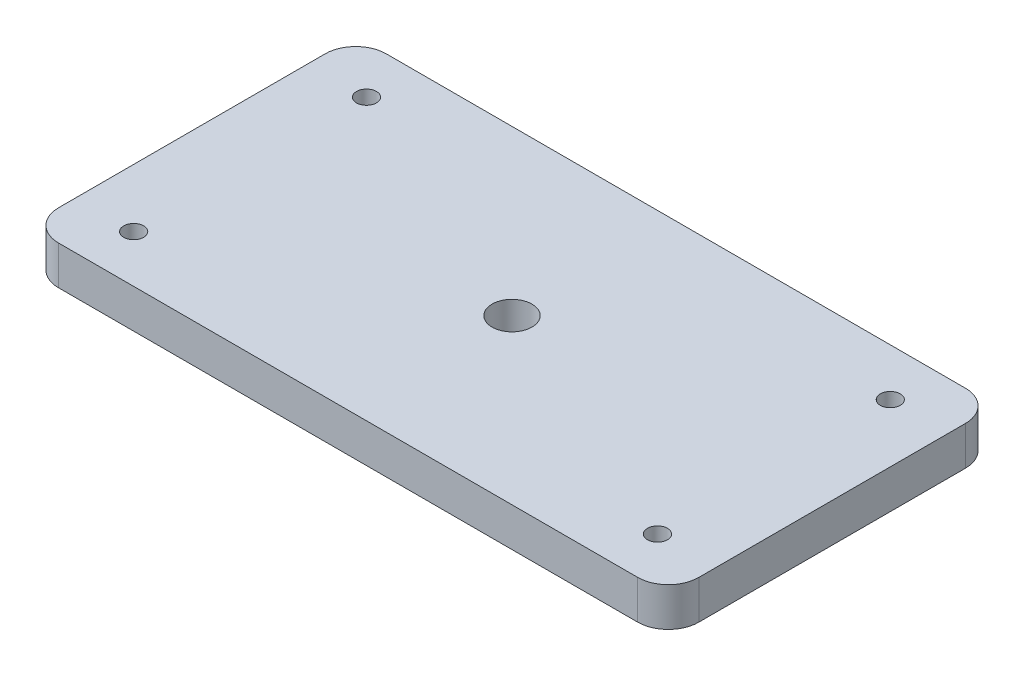
ISO-10303-21;
HEADER;
FILE_DESCRIPTION(('STEP AP214'),'2;1');
FILE_NAME('part.step','',(''),(''),'','','');
FILE_SCHEMA(('AUTOMOTIVE_DESIGN { 1 0 10303 214 1 1 1 1 }'));
ENDSEC;
DATA;
#1=APPLICATION_CONTEXT('core data for automotive mechanical design processes');
#2=APPLICATION_PROTOCOL_DEFINITION('international standard','automotive_design',2000,#1);
#3=PRODUCT_CONTEXT('',#1,'mechanical');
#4=PRODUCT('Part','Part','',(#3));
#5=PRODUCT_RELATED_PRODUCT_CATEGORY('part','',(#4));
#6=PRODUCT_DEFINITION_FORMATION('','',#4);
#7=PRODUCT_DEFINITION_CONTEXT('part definition',#1,'design');
#8=PRODUCT_DEFINITION('design','',#6,#7);
#9=PRODUCT_DEFINITION_SHAPE('','',#8);
#10=(LENGTH_UNIT() NAMED_UNIT(*) SI_UNIT(.MILLI.,.METRE.));
#11=(NAMED_UNIT(*) PLANE_ANGLE_UNIT() SI_UNIT($,.RADIAN.));
#12=(NAMED_UNIT(*) SI_UNIT($,.STERADIAN.) SOLID_ANGLE_UNIT());
#13=UNCERTAINTY_MEASURE_WITH_UNIT(LENGTH_MEASURE(1.E-05),#10,'distance_accuracy_value','');
#14=(GEOMETRIC_REPRESENTATION_CONTEXT(3) GLOBAL_UNCERTAINTY_ASSIGNED_CONTEXT((#13)) GLOBAL_UNIT_ASSIGNED_CONTEXT((#10,
#11,#12)) REPRESENTATION_CONTEXT('',''));
#15=CARTESIAN_POINT('',(0.,0.,0.));
#16=DIRECTION('',(0.,0.,1.));
#17=DIRECTION('',(1.,0.,0.));
#18=AXIS2_PLACEMENT_3D('',#15,#16,#17);
#19=CARTESIAN_POINT('',(0.,6.35,-53.63));
#20=DIRECTION('',(1.,0.,0.));
#21=DIRECTION('',(0.,0.,-1.));
#22=AXIS2_PLACEMENT_3D('',#19,#20,#21);
#23=PLANE('',#22);
#24=DIRECTION('',(0.,0.,1.));
#25=VECTOR('',#24,1.);
#26=CARTESIAN_POINT('',(0.,6.35,-53.63));
#27=LINE('',#26,#25);
#28=CARTESIAN_POINT('',(0.,6.35,-48.63));
#29=VERTEX_POINT('',#28);
#30=CARTESIAN_POINT('',(0.,6.35,-5.));
#31=VERTEX_POINT('',#30);
#32=EDGE_CURVE('E126',#29,#31,#27,.T.);
#33=ORIENTED_EDGE('',*,*,#32,.F.);
#34=DIRECTION('',(0.,-1.,0.));
#35=VECTOR('',#34,1.);
#36=CARTESIAN_POINT('',(0.,6.35,-48.63));
#37=LINE('',#36,#35);
#38=CARTESIAN_POINT('',(0.,0.,-48.63));
#39=VERTEX_POINT('',#38);
#40=EDGE_CURVE('E110',#29,#39,#37,.T.);
#41=ORIENTED_EDGE('',*,*,#40,.T.);
#42=DIRECTION('',(0.,0.,1.));
#43=VECTOR('',#42,1.);
#44=CARTESIAN_POINT('',(0.,0.,-53.63));
#45=LINE('',#44,#43);
#46=CARTESIAN_POINT('',(0.,0.,-5.));
#47=VERTEX_POINT('',#46);
#48=EDGE_CURVE('E123',#39,#47,#45,.T.);
#49=ORIENTED_EDGE('',*,*,#48,.T.);
#50=DIRECTION('',(0.,-1.,0.));
#51=VECTOR('',#50,1.);
#52=CARTESIAN_POINT('',(0.,6.35,-5.));
#53=LINE('',#52,#51);
#54=EDGE_CURVE('E129',#47,#31,#53,.F.);
#55=ORIENTED_EDGE('',*,*,#54,.T.);
#56=EDGE_LOOP('',(#33,#41,#49,#55));
#57=FACE_BOUND('',#56,.T.);
#58=ADVANCED_FACE('F39',(#57),#23,.F.);
#59=CARTESIAN_POINT('',(0.,6.35,0.));
#60=DIRECTION('',(0.,0.,-1.));
#61=DIRECTION('',(-1.,0.,0.));
#62=AXIS2_PLACEMENT_3D('',#59,#60,#61);
#63=PLANE('',#62);
#64=DIRECTION('',(1.,0.,0.));
#65=VECTOR('',#64,1.);
#66=CARTESIAN_POINT('',(0.,0.,0.));
#67=LINE('',#66,#65);
#68=CARTESIAN_POINT('',(5.,0.,0.));
#69=VERTEX_POINT('',#68);
#70=CARTESIAN_POINT('',(99.78,0.,0.));
#71=VERTEX_POINT('',#70);
#72=EDGE_CURVE('E134',#69,#71,#67,.T.);
#73=ORIENTED_EDGE('',*,*,#72,.T.);
#74=DIRECTION('',(0.,-1.,0.));
#75=VECTOR('',#74,1.);
#76=CARTESIAN_POINT('',(99.78,6.35,0.));
#77=LINE('',#76,#75);
#78=CARTESIAN_POINT('',(99.78,6.35,0.));
#79=VERTEX_POINT('',#78);
#80=EDGE_CURVE('E11',#71,#79,#77,.F.);
#81=ORIENTED_EDGE('',*,*,#80,.T.);
#82=DIRECTION('',(1.,0.,0.));
#83=VECTOR('',#82,1.);
#84=CARTESIAN_POINT('',(0.,6.35,0.));
#85=LINE('',#84,#83);
#86=CARTESIAN_POINT('',(5.,6.35,0.));
#87=VERTEX_POINT('',#86);
#88=EDGE_CURVE('E191',#87,#79,#85,.T.);
#89=ORIENTED_EDGE('',*,*,#88,.F.);
#90=DIRECTION('',(0.,-1.,0.));
#91=VECTOR('',#90,1.);
#92=CARTESIAN_POINT('',(5.,6.35,0.));
#93=LINE('',#92,#91);
#94=EDGE_CURVE('E48',#87,#69,#93,.T.);
#95=ORIENTED_EDGE('',*,*,#94,.T.);
#96=EDGE_LOOP('',(#73,#81,#89,#95));
#97=FACE_BOUND('',#96,.T.);
#98=ADVANCED_FACE('F189',(#97),#63,.F.);
#99=CARTESIAN_POINT('',(104.78,6.35,-53.63));
#100=DIRECTION('',(-1.,0.,0.));
#101=DIRECTION('',(0.,0.,1.));
#102=AXIS2_PLACEMENT_3D('',#99,#100,#101);
#103=PLANE('',#102);
#104=DIRECTION('',(0.,0.,-1.));
#105=VECTOR('',#104,1.);
#106=CARTESIAN_POINT('',(104.78,0.,-53.63));
#107=LINE('',#106,#105);
#108=CARTESIAN_POINT('',(104.78,0.,-5.));
#109=VERTEX_POINT('',#108);
#110=CARTESIAN_POINT('',(104.78,0.,-48.63));
#111=VERTEX_POINT('',#110);
#112=EDGE_CURVE('E140',#109,#111,#107,.T.);
#113=ORIENTED_EDGE('',*,*,#112,.T.);
#114=DIRECTION('',(0.,-1.,0.));
#115=VECTOR('',#114,1.);
#116=CARTESIAN_POINT('',(104.78,6.35,-48.63));
#117=LINE('',#116,#115);
#118=CARTESIAN_POINT('',(104.78,6.35,-48.63));
#119=VERTEX_POINT('',#118);
#120=EDGE_CURVE('E55',#111,#119,#117,.F.);
#121=ORIENTED_EDGE('',*,*,#120,.T.);
#122=DIRECTION('',(0.,0.,-1.));
#123=VECTOR('',#122,1.);
#124=CARTESIAN_POINT('',(104.78,6.35,-53.63));
#125=LINE('',#124,#123);
#126=CARTESIAN_POINT('',(104.78,6.35,-5.));
#127=VERTEX_POINT('',#126);
#128=EDGE_CURVE('E199',#127,#119,#125,.T.);
#129=ORIENTED_EDGE('',*,*,#128,.F.);
#130=DIRECTION('',(0.,-1.,0.));
#131=VECTOR('',#130,1.);
#132=CARTESIAN_POINT('',(104.78,6.35,-5.));
#133=LINE('',#132,#131);
#134=EDGE_CURVE('E179',#127,#109,#133,.T.);
#135=ORIENTED_EDGE('',*,*,#134,.T.);
#136=EDGE_LOOP('',(#113,#121,#129,#135));
#137=FACE_BOUND('',#136,.T.);
#138=ADVANCED_FACE('F198',(#137),#103,.F.);
#139=CARTESIAN_POINT('',(0.,6.35,-53.63));
#140=DIRECTION('',(0.,0.,1.));
#141=DIRECTION('',(1.,0.,0.));
#142=AXIS2_PLACEMENT_3D('',#139,#140,#141);
#143=PLANE('',#142);
#144=DIRECTION('',(-1.,0.,0.));
#145=VECTOR('',#144,1.);
#146=CARTESIAN_POINT('',(0.,0.,-53.63));
#147=LINE('',#146,#145);
#148=CARTESIAN_POINT('',(99.78,0.,-53.63));
#149=VERTEX_POINT('',#148);
#150=CARTESIAN_POINT('',(5.,0.,-53.63));
#151=VERTEX_POINT('',#150);
#152=EDGE_CURVE('E151',#149,#151,#147,.T.);
#153=ORIENTED_EDGE('',*,*,#152,.T.);
#154=DIRECTION('',(0.,-1.,0.));
#155=VECTOR('',#154,1.);
#156=CARTESIAN_POINT('',(5.,6.35,-53.63));
#157=LINE('',#156,#155);
#158=CARTESIAN_POINT('',(5.,6.35,-53.63));
#159=VERTEX_POINT('',#158);
#160=EDGE_CURVE('E111',#151,#159,#157,.F.);
#161=ORIENTED_EDGE('',*,*,#160,.T.);
#162=DIRECTION('',(-1.,0.,0.));
#163=VECTOR('',#162,1.);
#164=CARTESIAN_POINT('',(0.,6.35,-53.63));
#165=LINE('',#164,#163);
#166=CARTESIAN_POINT('',(99.78,6.35,-53.63));
#167=VERTEX_POINT('',#166);
#168=EDGE_CURVE('E146',#167,#159,#165,.T.);
#169=ORIENTED_EDGE('',*,*,#168,.F.);
#170=DIRECTION('',(0.,-1.,0.));
#171=VECTOR('',#170,1.);
#172=CARTESIAN_POINT('',(99.78,6.35,-53.63));
#173=LINE('',#172,#171);
#174=EDGE_CURVE('E117',#167,#149,#173,.T.);
#175=ORIENTED_EDGE('',*,*,#174,.T.);
#176=EDGE_LOOP('',(#153,#161,#169,#175));
#177=FACE_BOUND('',#176,.T.);
#178=ADVANCED_FACE('F294',(#177),#143,.F.);
#179=CARTESIAN_POINT('',(0.,6.35,0.));
#180=DIRECTION('',(0.,1.,0.));
#181=DIRECTION('',(0.,0.,1.));
#182=AXIS2_PLACEMENT_3D('',#179,#180,#181);
#183=PLANE('',#182);
#184=CARTESIAN_POINT('',(9.52499999999998,6.35,-7.76499999999994));
#185=DIRECTION('',(0.,-1.,0.));
#186=DIRECTION('',(0.,0.,-1.));
#187=AXIS2_PLACEMENT_3D('',#184,#185,#186);
#188=CIRCLE('',#187,1.63195);
#189=CARTESIAN_POINT('',(9.52499999999998,6.35,-9.39694999999993));
#190=VERTEX_POINT('',#189);
#191=EDGE_CURVE('E236',#190,#190,#188,.T.);
#192=ORIENTED_EDGE('',*,*,#191,.T.);
#193=EDGE_LOOP('',(#192));
#194=FACE_BOUND('',#193,.T.);
#195=CARTESIAN_POINT('',(9.52499999999998,6.35,-45.865));
#196=DIRECTION('',(0.,-1.,0.));
#197=DIRECTION('',(0.,0.,-1.));
#198=AXIS2_PLACEMENT_3D('',#195,#196,#197);
#199=CIRCLE('',#198,1.63195);
#200=CARTESIAN_POINT('',(9.52499999999998,6.35,-47.49695));
#201=VERTEX_POINT('',#200);
#202=EDGE_CURVE('E228',#201,#201,#199,.T.);
#203=ORIENTED_EDGE('',*,*,#202,.T.);
#204=EDGE_LOOP('',(#203));
#205=FACE_BOUND('',#204,.T.);
#206=CARTESIAN_POINT('',(95.25,6.35,-45.8649999999999));
#207=DIRECTION('',(0.,-1.,0.));
#208=DIRECTION('',(0.,0.,-1.));
#209=AXIS2_PLACEMENT_3D('',#206,#207,#208);
#210=CIRCLE('',#209,1.63194999999999);
#211=CARTESIAN_POINT('',(95.25,6.35,-47.4969499999999));
#212=VERTEX_POINT('',#211);
#213=EDGE_CURVE('E220',#212,#212,#210,.T.);
#214=ORIENTED_EDGE('',*,*,#213,.T.);
#215=EDGE_LOOP('',(#214));
#216=FACE_BOUND('',#215,.T.);
#217=CARTESIAN_POINT('',(95.25,6.35,-7.76499999999993));
#218=DIRECTION('',(0.,-1.,0.));
#219=DIRECTION('',(0.,0.,-1.));
#220=AXIS2_PLACEMENT_3D('',#217,#218,#219);
#221=CIRCLE('',#220,1.63194999999999);
#222=CARTESIAN_POINT('',(95.25,6.35,-9.39694999999992));
#223=VERTEX_POINT('',#222);
#224=EDGE_CURVE('E212',#223,#223,#221,.T.);
#225=ORIENTED_EDGE('',*,*,#224,.T.);
#226=EDGE_LOOP('',(#225));
#227=FACE_BOUND('',#226,.T.);
#228=CARTESIAN_POINT('',(52.39,6.35,-26.815));
#229=DIRECTION('',(0.,-1.,0.));
#230=DIRECTION('',(0.,0.,-1.));
#231=AXIS2_PLACEMENT_3D('',#228,#229,#230);
#232=CIRCLE('',#231,3.2639);
#233=CARTESIAN_POINT('',(52.39,6.35,-30.0789));
#234=VERTEX_POINT('',#233);
#235=EDGE_CURVE('E135',#234,#234,#232,.T.);
#236=ORIENTED_EDGE('',*,*,#235,.T.);
#237=EDGE_LOOP('',(#236));
#238=FACE_BOUND('',#237,.T.);
#239=ORIENTED_EDGE('',*,*,#168,.T.);
#240=CARTESIAN_POINT('',(5.,6.35,-48.63));
#241=DIRECTION('',(0.,1.,0.));
#242=DIRECTION('',(0.,0.,1.));
#243=AXIS2_PLACEMENT_3D('',#240,#241,#242);
#244=CIRCLE('',#243,5.);
#245=EDGE_CURVE('E176',#159,#29,#244,.T.);
#246=ORIENTED_EDGE('',*,*,#245,.T.);
#247=ORIENTED_EDGE('',*,*,#32,.T.);
#248=CARTESIAN_POINT('',(5.,6.35,-5.));
#249=DIRECTION('',(0.,1.,0.));
#250=DIRECTION('',(0.,0.,1.));
#251=AXIS2_PLACEMENT_3D('',#248,#249,#250);
#252=CIRCLE('',#251,5.);
#253=EDGE_CURVE('E168',#31,#87,#252,.T.);
#254=ORIENTED_EDGE('',*,*,#253,.T.);
#255=ORIENTED_EDGE('',*,*,#88,.T.);
#256=CARTESIAN_POINT('',(99.78,6.35,-5.));
#257=DIRECTION('',(0.,1.,0.));
#258=DIRECTION('',(0.,0.,1.));
#259=AXIS2_PLACEMENT_3D('',#256,#257,#258);
#260=CIRCLE('',#259,5.);
#261=EDGE_CURVE('E62',#79,#127,#260,.T.);
#262=ORIENTED_EDGE('',*,*,#261,.T.);
#263=ORIENTED_EDGE('',*,*,#128,.T.);
#264=CARTESIAN_POINT('',(99.78,6.35,-48.63));
#265=DIRECTION('',(0.,1.,0.));
#266=DIRECTION('',(0.,0.,1.));
#267=AXIS2_PLACEMENT_3D('',#264,#265,#266);
#268=CIRCLE('',#267,5.);
#269=EDGE_CURVE('E173',#119,#167,#268,.T.);
#270=ORIENTED_EDGE('',*,*,#269,.T.);
#271=EDGE_LOOP('',(#239,#246,#247,#254,#255,#262,#263,#270));
#272=FACE_BOUND('',#271,.T.);
#273=ADVANCED_FACE('F250',(#194,#205,#216,#227,#238,#272),#183,.T.);
#274=CARTESIAN_POINT('',(0.,0.,0.));
#275=DIRECTION('',(0.,1.,0.));
#276=DIRECTION('',(0.,0.,1.));
#277=AXIS2_PLACEMENT_3D('',#274,#275,#276);
#278=PLANE('',#277);
#279=CARTESIAN_POINT('',(9.52499999999998,0.,-7.76499999999994));
#280=DIRECTION('',(0.,-1.,0.));
#281=DIRECTION('',(0.,0.,-1.));
#282=AXIS2_PLACEMENT_3D('',#279,#280,#281);
#283=CIRCLE('',#282,1.63195);
#284=CARTESIAN_POINT('',(9.52499999999998,0.,-9.39694999999994));
#285=VERTEX_POINT('',#284);
#286=EDGE_CURVE('E240',#285,#285,#283,.T.);
#287=ORIENTED_EDGE('',*,*,#286,.F.);
#288=EDGE_LOOP('',(#287));
#289=FACE_BOUND('',#288,.T.);
#290=CARTESIAN_POINT('',(9.52499999999998,0.,-45.865));
#291=DIRECTION('',(0.,-1.,0.));
#292=DIRECTION('',(0.,0.,-1.));
#293=AXIS2_PLACEMENT_3D('',#290,#291,#292);
#294=CIRCLE('',#293,1.63195);
#295=CARTESIAN_POINT('',(9.52499999999998,0.,-47.49695));
#296=VERTEX_POINT('',#295);
#297=EDGE_CURVE('E232',#296,#296,#294,.T.);
#298=ORIENTED_EDGE('',*,*,#297,.F.);
#299=EDGE_LOOP('',(#298));
#300=FACE_BOUND('',#299,.T.);
#301=CARTESIAN_POINT('',(95.25,0.,-45.8649999999999));
#302=DIRECTION('',(0.,-1.,0.));
#303=DIRECTION('',(0.,0.,-1.));
#304=AXIS2_PLACEMENT_3D('',#301,#302,#303);
#305=CIRCLE('',#304,1.63194999999999);
#306=CARTESIAN_POINT('',(95.25,0.,-47.4969499999999));
#307=VERTEX_POINT('',#306);
#308=EDGE_CURVE('E224',#307,#307,#305,.T.);
#309=ORIENTED_EDGE('',*,*,#308,.F.);
#310=EDGE_LOOP('',(#309));
#311=FACE_BOUND('',#310,.T.);
#312=CARTESIAN_POINT('',(95.25,0.,-7.76499999999993));
#313=DIRECTION('',(0.,-1.,0.));
#314=DIRECTION('',(0.,0.,-1.));
#315=AXIS2_PLACEMENT_3D('',#312,#313,#314);
#316=CIRCLE('',#315,1.63194999999999);
#317=CARTESIAN_POINT('',(95.25,0.,-9.39694999999992));
#318=VERTEX_POINT('',#317);
#319=EDGE_CURVE('E216',#318,#318,#316,.T.);
#320=ORIENTED_EDGE('',*,*,#319,.F.);
#321=EDGE_LOOP('',(#320));
#322=FACE_BOUND('',#321,.T.);
#323=CARTESIAN_POINT('',(52.39,0.,-26.815));
#324=DIRECTION('',(0.,-1.,0.));
#325=DIRECTION('',(0.,0.,-1.));
#326=AXIS2_PLACEMENT_3D('',#323,#324,#325);
#327=CIRCLE('',#326,3.2639);
#328=CARTESIAN_POINT('',(52.39,0.,-30.0789));
#329=VERTEX_POINT('',#328);
#330=EDGE_CURVE('E143',#329,#329,#327,.T.);
#331=ORIENTED_EDGE('',*,*,#330,.F.);
#332=EDGE_LOOP('',(#331));
#333=FACE_BOUND('',#332,.T.);
#334=ORIENTED_EDGE('',*,*,#48,.F.);
#335=CARTESIAN_POINT('',(5.,0.,-48.63));
#336=DIRECTION('',(0.,1.,0.));
#337=DIRECTION('',(0.,0.,1.));
#338=AXIS2_PLACEMENT_3D('',#335,#336,#337);
#339=CIRCLE('',#338,5.);
#340=EDGE_CURVE('E106',#39,#151,#339,.F.);
#341=ORIENTED_EDGE('',*,*,#340,.T.);
#342=ORIENTED_EDGE('',*,*,#152,.F.);
#343=CARTESIAN_POINT('',(99.78,0.,-48.63));
#344=DIRECTION('',(0.,1.,0.));
#345=DIRECTION('',(0.,0.,1.));
#346=AXIS2_PLACEMENT_3D('',#343,#344,#345);
#347=CIRCLE('',#346,5.);
#348=EDGE_CURVE('E118',#149,#111,#347,.F.);
#349=ORIENTED_EDGE('',*,*,#348,.T.);
#350=ORIENTED_EDGE('',*,*,#112,.F.);
#351=CARTESIAN_POINT('',(99.78,0.,-5.));
#352=DIRECTION('',(0.,1.,0.));
#353=DIRECTION('',(0.,0.,1.));
#354=AXIS2_PLACEMENT_3D('',#351,#352,#353);
#355=CIRCLE('',#354,5.);
#356=EDGE_CURVE('E158',#109,#71,#355,.F.);
#357=ORIENTED_EDGE('',*,*,#356,.T.);
#358=ORIENTED_EDGE('',*,*,#72,.F.);
#359=CARTESIAN_POINT('',(5.,0.,-5.));
#360=DIRECTION('',(0.,1.,0.));
#361=DIRECTION('',(0.,0.,1.));
#362=AXIS2_PLACEMENT_3D('',#359,#360,#361);
#363=CIRCLE('',#362,5.);
#364=EDGE_CURVE('E128',#69,#47,#363,.F.);
#365=ORIENTED_EDGE('',*,*,#364,.T.);
#366=EDGE_LOOP('',(#334,#341,#342,#349,#350,#357,#358,#365));
#367=FACE_BOUND('',#366,.T.);
#368=ADVANCED_FACE('F131',(#289,#300,#311,#322,#333,#367),#278,.F.);
#369=CARTESIAN_POINT('',(52.39,0.,-26.815));
#370=DIRECTION('',(0.,-1.,0.));
#371=DIRECTION('',(0.,0.,-1.));
#372=AXIS2_PLACEMENT_3D('',#369,#370,#371);
#373=CYLINDRICAL_SURFACE('',#372,3.2639);
#374=ORIENTED_EDGE('',*,*,#235,.F.);
#375=EDGE_LOOP('',(#374));
#376=FACE_BOUND('',#375,.T.);
#377=ORIENTED_EDGE('',*,*,#330,.T.);
#378=EDGE_LOOP('',(#377));
#379=FACE_BOUND('',#378,.T.);
#380=ADVANCED_FACE('F249',(#376,#379),#373,.F.);
#381=CARTESIAN_POINT('',(95.25,0.,-7.76499999999993));
#382=DIRECTION('',(0.,-1.,0.));
#383=DIRECTION('',(0.,0.,-1.));
#384=AXIS2_PLACEMENT_3D('',#381,#382,#383);
#385=CYLINDRICAL_SURFACE('',#384,1.63194999999999);
#386=ORIENTED_EDGE('',*,*,#224,.F.);
#387=EDGE_LOOP('',(#386));
#388=FACE_BOUND('',#387,.T.);
#389=ORIENTED_EDGE('',*,*,#319,.T.);
#390=EDGE_LOOP('',(#389));
#391=FACE_BOUND('',#390,.T.);
#392=ADVANCED_FACE('F261',(#388,#391),#385,.F.);
#393=CARTESIAN_POINT('',(95.25,0.,-45.8649999999999));
#394=DIRECTION('',(0.,-1.,0.));
#395=DIRECTION('',(0.,0.,-1.));
#396=AXIS2_PLACEMENT_3D('',#393,#394,#395);
#397=CYLINDRICAL_SURFACE('',#396,1.63194999999999);
#398=ORIENTED_EDGE('',*,*,#213,.F.);
#399=EDGE_LOOP('',(#398));
#400=FACE_BOUND('',#399,.T.);
#401=ORIENTED_EDGE('',*,*,#308,.T.);
#402=EDGE_LOOP('',(#401));
#403=FACE_BOUND('',#402,.T.);
#404=ADVANCED_FACE('F267',(#400,#403),#397,.F.);
#405=CARTESIAN_POINT('',(9.52499999999998,0.,-45.865));
#406=DIRECTION('',(0.,-1.,0.));
#407=DIRECTION('',(0.,0.,-1.));
#408=AXIS2_PLACEMENT_3D('',#405,#406,#407);
#409=CYLINDRICAL_SURFACE('',#408,1.63195);
#410=ORIENTED_EDGE('',*,*,#202,.F.);
#411=EDGE_LOOP('',(#410));
#412=FACE_BOUND('',#411,.T.);
#413=ORIENTED_EDGE('',*,*,#297,.T.);
#414=EDGE_LOOP('',(#413));
#415=FACE_BOUND('',#414,.T.);
#416=ADVANCED_FACE('F321',(#412,#415),#409,.F.);
#417=CARTESIAN_POINT('',(9.52499999999998,0.,-7.76499999999994));
#418=DIRECTION('',(0.,-1.,0.));
#419=DIRECTION('',(0.,0.,-1.));
#420=AXIS2_PLACEMENT_3D('',#417,#418,#419);
#421=CYLINDRICAL_SURFACE('',#420,1.63195);
#422=ORIENTED_EDGE('',*,*,#191,.F.);
#423=EDGE_LOOP('',(#422));
#424=FACE_BOUND('',#423,.T.);
#425=ORIENTED_EDGE('',*,*,#286,.T.);
#426=EDGE_LOOP('',(#425));
#427=FACE_BOUND('',#426,.T.);
#428=ADVANCED_FACE('F245',(#424,#427),#421,.F.);
#429=CARTESIAN_POINT('',(5.,6.35,-48.63));
#430=DIRECTION('',(0.,-1.,0.));
#431=DIRECTION('',(0.,0.,-1.));
#432=AXIS2_PLACEMENT_3D('',#429,#430,#431);
#433=CYLINDRICAL_SURFACE('',#432,5.);
#434=ORIENTED_EDGE('',*,*,#245,.F.);
#435=ORIENTED_EDGE('',*,*,#160,.F.);
#436=ORIENTED_EDGE('',*,*,#340,.F.);
#437=ORIENTED_EDGE('',*,*,#40,.F.);
#438=EDGE_LOOP('',(#434,#435,#436,#437));
#439=FACE_BOUND('',#438,.T.);
#440=ADVANCED_FACE('F109',(#439),#433,.T.);
#441=CARTESIAN_POINT('',(99.78,6.35,-48.63));
#442=DIRECTION('',(0.,-1.,0.));
#443=DIRECTION('',(0.,0.,-1.));
#444=AXIS2_PLACEMENT_3D('',#441,#442,#443);
#445=CYLINDRICAL_SURFACE('',#444,5.);
#446=ORIENTED_EDGE('',*,*,#269,.F.);
#447=ORIENTED_EDGE('',*,*,#120,.F.);
#448=ORIENTED_EDGE('',*,*,#348,.F.);
#449=ORIENTED_EDGE('',*,*,#174,.F.);
#450=EDGE_LOOP('',(#446,#447,#448,#449));
#451=FACE_BOUND('',#450,.T.);
#452=ADVANCED_FACE('F282',(#451),#445,.T.);
#453=CARTESIAN_POINT('',(99.78,6.35,-5.));
#454=DIRECTION('',(0.,-1.,0.));
#455=DIRECTION('',(0.,0.,-1.));
#456=AXIS2_PLACEMENT_3D('',#453,#454,#455);
#457=CYLINDRICAL_SURFACE('',#456,5.);
#458=ORIENTED_EDGE('',*,*,#261,.F.);
#459=ORIENTED_EDGE('',*,*,#80,.F.);
#460=ORIENTED_EDGE('',*,*,#356,.F.);
#461=ORIENTED_EDGE('',*,*,#134,.F.);
#462=EDGE_LOOP('',(#458,#459,#460,#461));
#463=FACE_BOUND('',#462,.T.);
#464=ADVANCED_FACE('F197',(#463),#457,.T.);
#465=CARTESIAN_POINT('',(5.,6.35,-5.));
#466=DIRECTION('',(0.,-1.,0.));
#467=DIRECTION('',(0.,0.,-1.));
#468=AXIS2_PLACEMENT_3D('',#465,#466,#467);
#469=CYLINDRICAL_SURFACE('',#468,5.);
#470=ORIENTED_EDGE('',*,*,#253,.F.);
#471=ORIENTED_EDGE('',*,*,#54,.F.);
#472=ORIENTED_EDGE('',*,*,#364,.F.);
#473=ORIENTED_EDGE('',*,*,#94,.F.);
#474=EDGE_LOOP('',(#470,#471,#472,#473));
#475=FACE_BOUND('',#474,.T.);
#476=ADVANCED_FACE('F41',(#475),#469,.T.);
#477=CLOSED_SHELL('',(#58,#98,#138,#178,#273,#368,#380,#392,#404,#416,#428,#440,#452,#464,#476));
#478=MANIFOLD_SOLID_BREP('B2',#477);
#479=ADVANCED_BREP_SHAPE_REPRESENTATION('',(#18,#478),#14);
#480=SHAPE_DEFINITION_REPRESENTATION(#9,#479);
ENDSEC;
END-ISO-10303-21;
